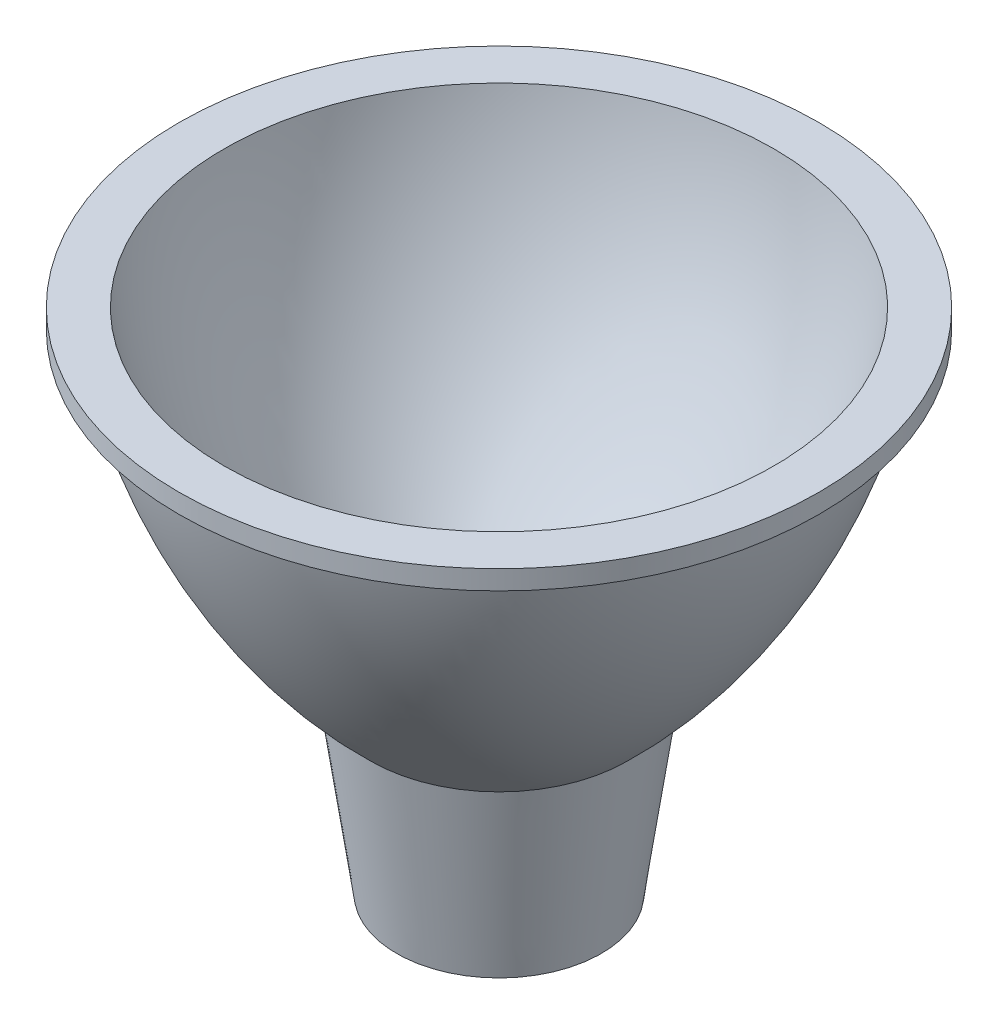
ISO-10303-21;
HEADER;
FILE_DESCRIPTION(('STEP AP214'),'2;1');
FILE_NAME('part.step','',(''),(''),'','','');
FILE_SCHEMA(('AUTOMOTIVE_DESIGN { 1 0 10303 214 1 1 1 1 }'));
ENDSEC;
DATA;
#1=APPLICATION_CONTEXT('core data for automotive mechanical design processes');
#2=APPLICATION_PROTOCOL_DEFINITION('international standard','automotive_design',2000,#1);
#3=PRODUCT_CONTEXT('',#1,'mechanical');
#4=PRODUCT('Part','Part','',(#3));
#5=PRODUCT_RELATED_PRODUCT_CATEGORY('part','',(#4));
#6=PRODUCT_DEFINITION_FORMATION('','',#4);
#7=PRODUCT_DEFINITION_CONTEXT('part definition',#1,'design');
#8=PRODUCT_DEFINITION('design','',#6,#7);
#9=PRODUCT_DEFINITION_SHAPE('','',#8);
#10=(LENGTH_UNIT() NAMED_UNIT(*) SI_UNIT(.MILLI.,.METRE.));
#11=(NAMED_UNIT(*) PLANE_ANGLE_UNIT() SI_UNIT($,.RADIAN.));
#12=(NAMED_UNIT(*) SI_UNIT($,.STERADIAN.) SOLID_ANGLE_UNIT());
#13=UNCERTAINTY_MEASURE_WITH_UNIT(LENGTH_MEASURE(1.E-05),#10,'distance_accuracy_value','');
#14=(GEOMETRIC_REPRESENTATION_CONTEXT(3) GLOBAL_UNCERTAINTY_ASSIGNED_CONTEXT((#13)) GLOBAL_UNIT_ASSIGNED_CONTEXT((#10,
#11,#12)) REPRESENTATION_CONTEXT('',''));
#15=CARTESIAN_POINT('',(0.,0.,0.));
#16=DIRECTION('',(0.,0.,1.));
#17=DIRECTION('',(1.,0.,0.));
#18=AXIS2_PLACEMENT_3D('',#15,#16,#17);
#19=CARTESIAN_POINT('',(0.,39.7,0.));
#20=DIRECTION('',(0.,-1.,0.));
#21=DIRECTION('',(0.,0.,-1.));
#22=AXIS2_PLACEMENT_3D('',#19,#20,#21);
#23=PLANE('',#22);
#24=CARTESIAN_POINT('',(0.,39.7,0.));
#25=DIRECTION('',(0.,-1.,0.));
#26=DIRECTION('',(0.,0.,-1.));
#27=AXIS2_PLACEMENT_3D('',#24,#25,#26);
#28=CIRCLE('',#27,21.4623865251951);
#29=CARTESIAN_POINT('',(0.,39.7,-21.4623865251951));
#30=VERTEX_POINT('',#29);
#31=EDGE_CURVE('E71',#30,#30,#28,.F.);
#32=ORIENTED_EDGE('',*,*,#31,.F.);
#33=EDGE_LOOP('',(#32));
#34=FACE_BOUND('',#33,.T.);
#35=CARTESIAN_POINT('',(0.,39.7,0.));
#36=DIRECTION('',(0.,-1.,0.));
#37=DIRECTION('',(0.,0.,-1.));
#38=AXIS2_PLACEMENT_3D('',#35,#36,#37);
#39=CIRCLE('',#38,25.);
#40=CARTESIAN_POINT('',(0.,39.7,-25.));
#41=VERTEX_POINT('',#40);
#42=EDGE_CURVE('E12',#41,#41,#39,.T.);
#43=ORIENTED_EDGE('',*,*,#42,.F.);
#44=EDGE_LOOP('',(#43));
#45=FACE_BOUND('',#44,.T.);
#46=ADVANCED_FACE('F49',(#34,#45),#23,.F.);
#47=CARTESIAN_POINT('',(0.,0.,0.));
#48=DIRECTION('',(0.,-1.,0.));
#49=DIRECTION('',(0.,0.,-1.));
#50=AXIS2_PLACEMENT_3D('',#47,#48,#49);
#51=CYLINDRICAL_SURFACE('',#50,25.);
#52=CARTESIAN_POINT('',(0.,38.2,0.));
#53=DIRECTION('',(0.,-1.,0.));
#54=DIRECTION('',(0.,0.,-1.));
#55=AXIS2_PLACEMENT_3D('',#52,#53,#54);
#56=CIRCLE('',#55,25.);
#57=CARTESIAN_POINT('',(0.,38.2,-25.));
#58=VERTEX_POINT('',#57);
#59=EDGE_CURVE('E55',#58,#58,#56,.T.);
#60=ORIENTED_EDGE('',*,*,#59,.F.);
#61=EDGE_LOOP('',(#60));
#62=FACE_BOUND('',#61,.T.);
#63=ORIENTED_EDGE('',*,*,#42,.T.);
#64=EDGE_LOOP('',(#63));
#65=FACE_BOUND('',#64,.T.);
#66=ADVANCED_FACE('F98',(#62,#65),#51,.T.);
#67=CARTESIAN_POINT('',(-25.,38.2,0.));
#68=DIRECTION('',(0.,1.,0.));
#69=DIRECTION('',(0.,0.,1.));
#70=AXIS2_PLACEMENT_3D('',#67,#68,#69);
#71=PLANE('',#70);
#72=CARTESIAN_POINT('',(0.,38.2,0.));
#73=DIRECTION('',(0.,-1.,0.));
#74=DIRECTION('',(0.,0.,-1.));
#75=AXIS2_PLACEMENT_3D('',#72,#73,#74);
#76=CIRCLE('',#75,23.2209737827716);
#77=CARTESIAN_POINT('',(0.,38.2,-23.2209737827716));
#78=VERTEX_POINT('',#77);
#79=EDGE_CURVE('E59',#78,#78,#76,.T.);
#80=ORIENTED_EDGE('',*,*,#79,.F.);
#81=EDGE_LOOP('',(#80));
#82=FACE_BOUND('',#81,.T.);
#83=ORIENTED_EDGE('',*,*,#59,.T.);
#84=EDGE_LOOP('',(#83));
#85=FACE_BOUND('',#84,.T.);
#86=ADVANCED_FACE('F103',(#82,#85),#71,.F.);
#87=CARTESIAN_POINT('',(0.,47.0166611083032,0.));
#88=DIRECTION('',(0.,-1.,0.));
#89=DIRECTION('',(0.,0.,-1.));
#90=AXIS2_PLACEMENT_3D('',#87,#88,#89);
#91=DEGENERATE_TOROIDAL_SURFACE('',#90,21.6758910364301,45.7543657336907,.F.);
#92=CARTESIAN_POINT('',(0.,14.,0.));
#93=DIRECTION('',(0.,-1.,0.));
#94=DIRECTION('',(0.,0.,-1.));
#95=AXIS2_PLACEMENT_3D('',#92,#93,#94);
#96=CIRCLE('',#95,10.);
#97=CARTESIAN_POINT('',(0.,14.,-10.));
#98=VERTEX_POINT('',#97);
#99=EDGE_CURVE('E63',#98,#98,#96,.T.);
#100=ORIENTED_EDGE('',*,*,#99,.F.);
#101=EDGE_LOOP('',(#100));
#102=FACE_BOUND('',#101,.T.);
#103=ORIENTED_EDGE('',*,*,#79,.T.);
#104=EDGE_LOOP('',(#103));
#105=FACE_BOUND('',#104,.T.);
#106=ADVANCED_FACE('F110',(#102,#105),#91,.F.);
#107=CARTESIAN_POINT('',(0.,14.,0.));
#108=DIRECTION('',(0.,1.,0.));
#109=DIRECTION('',(0.,0.,1.));
#110=AXIS2_PLACEMENT_3D('',#107,#108,#109);
#111=CONICAL_SURFACE('',#110,10.,0.141897054604164);
#112=CARTESIAN_POINT('',(0.,0.,0.));
#113=DIRECTION('',(0.,-1.,0.));
#114=DIRECTION('',(0.,0.,-1.));
#115=AXIS2_PLACEMENT_3D('',#112,#113,#114);
#116=CIRCLE('',#115,8.);
#117=CARTESIAN_POINT('',(0.,0.,-8.));
#118=VERTEX_POINT('',#117);
#119=EDGE_CURVE('E68',#118,#118,#116,.T.);
#120=ORIENTED_EDGE('',*,*,#119,.F.);
#121=EDGE_LOOP('',(#120));
#122=FACE_BOUND('',#121,.T.);
#123=ORIENTED_EDGE('',*,*,#99,.T.);
#124=EDGE_LOOP('',(#123));
#125=FACE_BOUND('',#124,.T.);
#126=ADVANCED_FACE('F116',(#122,#125),#111,.T.);
#127=CARTESIAN_POINT('',(0.,0.,0.));
#128=DIRECTION('',(0.,1.,0.));
#129=DIRECTION('',(0.,0.,1.));
#130=AXIS2_PLACEMENT_3D('',#127,#128,#129);
#131=PLANE('',#130);
#132=ORIENTED_EDGE('',*,*,#119,.T.);
#133=EDGE_LOOP('',(#132));
#134=FACE_BOUND('',#133,.T.);
#135=ADVANCED_FACE('F94',(#134),#131,.F.);
#136=CARTESIAN_POINT('',(0.,47.0166611083032,0.));
#137=DIRECTION('',(0.,-1.,0.));
#138=DIRECTION('',(0.,0.,-1.));
#139=AXIS2_PLACEMENT_3D('',#136,#137,#138);
#140=DEGENERATE_TOROIDAL_SURFACE('',#139,21.6758910364301,43.7543657336907,.F.);
#141=ORIENTED_EDGE('',*,*,#31,.T.);
#142=EDGE_LOOP('',(#141));
#143=FACE_BOUND('',#142,.T.);
#144=CARTESIAN_POINT('',(0.,14.9742424711052,0.));
#145=DIRECTION('',(0.,1.,0.));
#146=DIRECTION('',(0.,0.,1.));
#147=AXIS2_PLACEMENT_3D('',#144,#145,#146);
#148=CIRCLE('',#147,8.11887240676775);
#149=CARTESIAN_POINT('',(0.,14.9742424711052,8.11887240676775));
#150=VERTEX_POINT('',#149);
#151=EDGE_CURVE('E74',#150,#150,#148,.F.);
#152=ORIENTED_EDGE('',*,*,#151,.T.);
#153=EDGE_LOOP('',(#152));
#154=FACE_BOUND('',#153,.T.);
#155=ADVANCED_FACE('F81',(#143,#154),#140,.T.);
#156=CARTESIAN_POINT('',(0.,14.2828427124746,0.));
#157=DIRECTION('',(0.,1.,0.));
#158=DIRECTION('',(0.,0.,1.));
#159=AXIS2_PLACEMENT_3D('',#156,#157,#158);
#160=CONICAL_SURFACE('',#159,8.02010101267767,0.141897054604164);
#161=CARTESIAN_POINT('',(0.,2.,0.));
#162=DIRECTION('',(0.,1.,0.));
#163=DIRECTION('',(0.,0.,1.));
#164=AXIS2_PLACEMENT_3D('',#161,#162,#163);
#165=CIRCLE('',#164,6.26540919660986);
#166=CARTESIAN_POINT('',(0.,2.,6.26540919660986));
#167=VERTEX_POINT('',#166);
#168=EDGE_CURVE('E75',#167,#167,#165,.F.);
#169=ORIENTED_EDGE('',*,*,#168,.T.);
#170=EDGE_LOOP('',(#169));
#171=FACE_BOUND('',#170,.T.);
#172=ORIENTED_EDGE('',*,*,#151,.F.);
#173=EDGE_LOOP('',(#172));
#174=FACE_BOUND('',#173,.T.);
#175=ADVANCED_FACE('F83',(#171,#174),#160,.F.);
#176=CARTESIAN_POINT('',(0.,2.,0.));
#177=DIRECTION('',(0.,1.,0.));
#178=DIRECTION('',(0.,0.,1.));
#179=AXIS2_PLACEMENT_3D('',#176,#177,#178);
#180=PLANE('',#179);
#181=ORIENTED_EDGE('',*,*,#168,.F.);
#182=EDGE_LOOP('',(#181));
#183=FACE_BOUND('',#182,.T.);
#184=ADVANCED_FACE('F85',(#183),#180,.T.);
#185=CLOSED_SHELL('',(#46,#66,#86,#106,#126,#135,#155,#175,#184));
#186=MANIFOLD_SOLID_BREP('B2',#185);
#187=ADVANCED_BREP_SHAPE_REPRESENTATION('',(#18,#186),#14);
#188=SHAPE_DEFINITION_REPRESENTATION(#9,#187);
ENDSEC;
END-ISO-10303-21;
